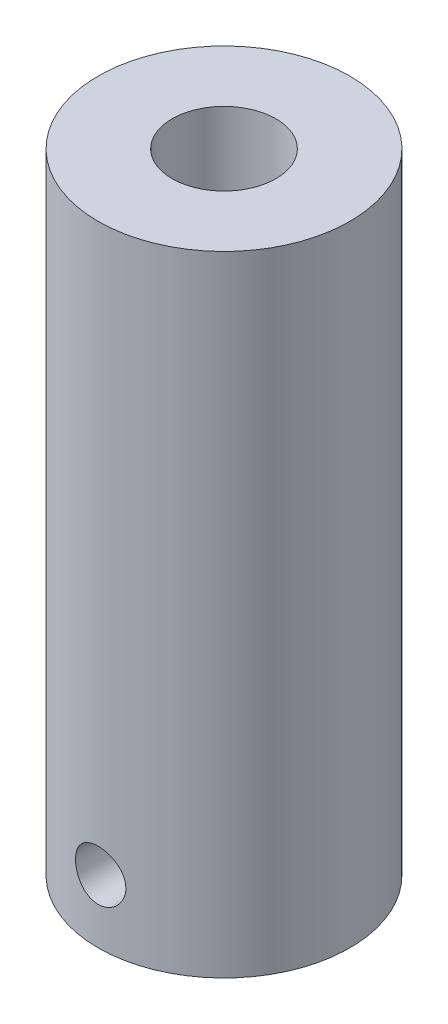
ISO-10303-21;
HEADER;
FILE_DESCRIPTION(('STEP AP214'),'2;1');
FILE_NAME('part.step','',(''),(''),'','','');
FILE_SCHEMA(('AUTOMOTIVE_DESIGN { 1 0 10303 214 1 1 1 1 }'));
ENDSEC;
DATA;
#1=APPLICATION_CONTEXT('core data for automotive mechanical design processes');
#2=APPLICATION_PROTOCOL_DEFINITION('international standard','automotive_design',2000,#1);
#3=PRODUCT_CONTEXT('',#1,'mechanical');
#4=PRODUCT('Part','Part','',(#3));
#5=PRODUCT_RELATED_PRODUCT_CATEGORY('part','',(#4));
#6=PRODUCT_DEFINITION_FORMATION('','',#4);
#7=PRODUCT_DEFINITION_CONTEXT('part definition',#1,'design');
#8=PRODUCT_DEFINITION('design','',#6,#7);
#9=PRODUCT_DEFINITION_SHAPE('','',#8);
#10=(LENGTH_UNIT() NAMED_UNIT(*) SI_UNIT(.MILLI.,.METRE.));
#11=(NAMED_UNIT(*) PLANE_ANGLE_UNIT() SI_UNIT($,.RADIAN.));
#12=(NAMED_UNIT(*) SI_UNIT($,.STERADIAN.) SOLID_ANGLE_UNIT());
#13=UNCERTAINTY_MEASURE_WITH_UNIT(LENGTH_MEASURE(1.E-05),#10,'distance_accuracy_value','');
#14=(GEOMETRIC_REPRESENTATION_CONTEXT(3) GLOBAL_UNCERTAINTY_ASSIGNED_CONTEXT((#13)) GLOBAL_UNIT_ASSIGNED_CONTEXT((#10,
#11,#12)) REPRESENTATION_CONTEXT('',''));
#15=CARTESIAN_POINT('',(0.,0.,0.));
#16=DIRECTION('',(0.,0.,1.));
#17=DIRECTION('',(1.,0.,0.));
#18=AXIS2_PLACEMENT_3D('',#15,#16,#17);
#19=CARTESIAN_POINT('',(0.,25.4,0.));
#20=DIRECTION('',(0.,-1.,0.));
#21=DIRECTION('',(0.,0.,-1.));
#22=AXIS2_PLACEMENT_3D('',#19,#20,#21);
#23=CYLINDRICAL_SURFACE('',#22,4.);
#24=CARTESIAN_POINT('',(-0.8,5.,3.91918358845308));
#25=CARTESIAN_POINT('',(-0.799998356700836,4.95554849961442,3.91918447235146));
#26=CARTESIAN_POINT('',(-0.796282537378925,4.91107630135481,3.91994806677531));
#27=CARTESIAN_POINT('',(-0.781529826870668,4.82338999590527,3.9229154510821));
#28=CARTESIAN_POINT('',(-0.770487077656945,4.78017692429514,3.92512039333066));
#29=CARTESIAN_POINT('',(-0.74143662609419,4.69629015730966,3.93071098960285));
#30=CARTESIAN_POINT('',(-0.723435851321666,4.65561398277206,3.9340954689225));
#31=CARTESIAN_POINT('',(-0.680999286136834,4.57786012424431,3.94166239589137));
#32=CARTESIAN_POINT('',(-0.656563854881037,4.54078223957018,3.94584479900011));
#33=CARTESIAN_POINT('',(-0.601583260522632,4.4707511969164,3.95460239754144));
#34=CARTESIAN_POINT('',(-0.570964524730623,4.43785632969268,3.9591819026946));
#35=CARTESIAN_POINT('',(-0.50464543121708,4.37763397313695,3.96817977842416));
#36=CARTESIAN_POINT('',(-0.468944717582396,4.35030687406628,3.97259813768756));
#37=CARTESIAN_POINT('',(-0.393089084739396,4.3017695858972,3.98082237133958));
#38=CARTESIAN_POINT('',(-0.352898054137767,4.28061478894668,3.98462257153216));
#39=CARTESIAN_POINT('',(-0.26944332030982,4.2453800503615,3.9911338950693));
#40=CARTESIAN_POINT('',(-0.226179905136443,4.23129944647921,3.99384512035302));
#41=CARTESIAN_POINT('',(-0.138413418622795,4.2107942451043,3.99784256550728));
#42=CARTESIAN_POINT('',(-0.0939341913718513,4.20427121794319,3.999147090305));
#43=CARTESIAN_POINT('',(-0.00449485475002944,4.19875923852935,4.00024736946885));
#44=CARTESIAN_POINT('',(0.0404652078654742,4.19976956028334,4.00004326922208));
#45=CARTESIAN_POINT('',(0.128913600594871,4.20922094417244,3.99816347894812));
#46=CARTESIAN_POINT('',(0.172413771438776,4.21755598173428,3.99650878692671));
#47=CARTESIAN_POINT('',(0.257385301264241,4.24125202596711,3.99193741727527));
#48=CARTESIAN_POINT('',(0.298856578997703,4.2566133137535,3.98902068915231));
#49=CARTESIAN_POINT('',(0.37889557056071,4.29402403211782,3.98221836815967));
#50=CARTESIAN_POINT('',(0.41744333930712,4.31611500088391,3.97832678540179));
#51=CARTESIAN_POINT('',(0.490324036687805,4.36632726178928,3.97000375579028));
#52=CARTESIAN_POINT('',(0.524656479620001,4.39444924781641,3.96557224684178));
#53=CARTESIAN_POINT('',(0.588761144842766,4.45650689768678,3.95656771491568));
#54=CARTESIAN_POINT('',(0.618443453258905,4.49053534938367,3.95199357166013));
#55=CARTESIAN_POINT('',(0.671694794541446,4.5631331539606,3.94329257279008));
#56=CARTESIAN_POINT('',(0.695263711782201,4.60170259270656,3.93916572563639));
#57=CARTESIAN_POINT('',(0.735650251841505,4.68241666545744,3.93182437978339));
#58=CARTESIAN_POINT('',(0.752453318222168,4.72456877411173,3.92861185250839));
#59=CARTESIAN_POINT('',(0.778712273302066,4.81117705897919,3.92349181057018));
#60=CARTESIAN_POINT('',(0.788169119565314,4.85563293409527,3.92158412582742));
#61=CARTESIAN_POINT('',(0.799332804828841,4.94477188639924,3.91932383414262));
#62=CARTESIAN_POINT('',(0.801169487118329,4.98943805944827,3.91894517645723));
#63=CARTESIAN_POINT('',(0.797390102648591,5.07843857855975,3.91971588551083));
#64=CARTESIAN_POINT('',(0.791774458497954,5.12277294329509,3.9208651656031));
#65=CARTESIAN_POINT('',(0.773361766459325,5.20941491223379,3.92453785995932));
#66=CARTESIAN_POINT('',(0.760634096671438,5.25173787442861,3.92704799211597));
#67=CARTESIAN_POINT('',(0.728432828246814,5.33365062322299,3.93314791481332));
#68=CARTESIAN_POINT('',(0.708958673898542,5.37324018434858,3.93673779429016));
#69=CARTESIAN_POINT('',(0.663523313772479,5.44913048796013,3.94465124769632));
#70=CARTESIAN_POINT('',(0.637480862386203,5.48538163704066,3.94898377491923));
#71=CARTESIAN_POINT('',(0.57975645777017,5.55304664960073,3.95786979061309));
#72=CARTESIAN_POINT('',(0.54807392411563,5.5844600145994,3.96242330179054));
#73=CARTESIAN_POINT('',(0.479385818798313,5.64205004734846,3.97132276695372));
#74=CARTESIAN_POINT('',(0.442305999143704,5.66813892372,3.97566446166947));
#75=CARTESIAN_POINT('',(0.364214317307805,5.71371670519967,3.98357702102896));
#76=CARTESIAN_POINT('',(0.323202620346806,5.73320588747583,3.98714791804169));
#77=CARTESIAN_POINT('',(0.23864214465921,5.76490309739731,3.99309835248853));
#78=CARTESIAN_POINT('',(0.195109338782462,5.777152414581,3.99548463314083));
#79=CARTESIAN_POINT('',(0.10655156374393,5.79415299813108,3.99882588750128));
#80=CARTESIAN_POINT('',(0.0615267749689716,5.79890516758055,3.99978103359875));
#81=CARTESIAN_POINT('',(-0.0278983151228984,5.80074158477031,4.00014832363297));
#82=CARTESIAN_POINT('',(-0.0722958497132015,5.79795782436497,3.99958702839481));
#83=CARTESIAN_POINT('',(-0.159976825052513,5.78509283956175,3.99704034848254));
#84=CARTESIAN_POINT('',(-0.203260279802953,5.77501170692154,3.99505498171481));
#85=CARTESIAN_POINT('',(-0.287402199796077,5.74789680632668,3.98988398692));
#86=CARTESIAN_POINT('',(-0.328265954592225,5.73087889749505,3.9867010979833));
#87=CARTESIAN_POINT('',(-0.406576976148762,5.69039020693528,3.97947777698706));
#88=CARTESIAN_POINT('',(-0.444023972613929,5.66691891527703,3.97543727716702));
#89=CARTESIAN_POINT('',(-0.515091112085086,5.61374449035034,3.96686079326295));
#90=CARTESIAN_POINT('',(-0.548639772893203,5.58394693089059,3.96231786737714));
#91=CARTESIAN_POINT('',(-0.610306094205477,5.51915980792338,3.95328978322898));
#92=CARTESIAN_POINT('',(-0.638422466562169,5.48416901642501,3.948804638903));
#93=CARTESIAN_POINT('',(-0.68871377556416,5.40953654663986,3.94034674199971));
#94=CARTESIAN_POINT('',(-0.710821451711813,5.36984883107171,3.93638002905062));
#95=CARTESIAN_POINT('',(-0.748019239430247,5.28725378136025,3.92948189747556));
#96=CARTESIAN_POINT('',(-0.763115716783432,5.24434940904167,3.92654954029565));
#97=CARTESIAN_POINT('',(-0.782935311883418,5.16779003565075,3.92263744903138));
#98=CARTESIAN_POINT('',(-0.789323118818388,5.13457166439084,3.92135027932529));
#99=CARTESIAN_POINT('',(-0.797856014368328,5.06757283635709,3.91962302766424));
#100=CARTESIAN_POINT('',(-0.800001249249644,5.03379239900146,3.91918291650621));
#101=CARTESIAN_POINT('',(-0.8,5.,3.91918358845308));
#102=B_SPLINE_CURVE_WITH_KNOTS('',3,(#24,#25,#26,#27,#28,#29,#30,#31,#32,#33,#34,#35,#36,#37,
#38,#39,#40,#41,#42,#43,#44,#45,#46,#47,#48,#49,#50,#51,#52,#53,#54,#55,#56,#57,#58,#59,#60,#61,
#62,#63,#64,#65,#66,#67,#68,#69,#70,#71,#72,#73,#74,#75,#76,#77,#78,#79,#80,#81,#82,#83,#84,#85,
#86,#87,#88,#89,#90,#91,#92,#93,#94,#95,#96,#97,#98,#99,#100,#101),.UNSPECIFIED.,.T.,.F.,(4,2,2,
2,2,2,2,2,2,2,2,2,2,2,2,2,2,2,2,2,2,2,2,2,2,2,2,2,2,2,2,2,2,2,2,2,2,2,4),(0.,0.13323077108522,
0.266568191407411,0.399773198332443,0.532970771867865,0.667858020367467,0.802754720263349,
0.938827203479576,1.07488694595245,1.20915399104462,1.34340809690996,1.47575031704827,
1.60809783256998,1.7412793937584,1.8744762861405,2.00999477407984,2.14551582496174,
2.28132690536219,2.41712028010817,2.55059006241672,2.68405227620735,2.81623473424653,
2.94842808281516,3.08234447817614,3.21627466294164,3.35226081384758,3.48824125302081,
3.62343850860918,3.758619477513,3.89144813929746,4.02427513091403,4.15680013658359,
4.28933561705745,4.42400921618475,4.55871471109822,4.6948711886123,4.83090380069144,
4.93219042907514,5.03347356545369),.UNSPECIFIED.);
#103=CARTESIAN_POINT('',(-0.8,5.,3.91918358845308));
#104=VERTEX_POINT('',#103);
#105=EDGE_CURVE('E59',#104,#104,#102,.T.);
#106=ORIENTED_EDGE('',*,*,#105,.F.);
#107=EDGE_LOOP('',(#106));
#108=FACE_BOUND('',#107,.T.);
#109=CARTESIAN_POINT('',(0.,3.,0.));
#110=DIRECTION('',(0.,1.,0.));
#111=DIRECTION('',(0.,0.,1.));
#112=AXIS2_PLACEMENT_3D('',#109,#110,#111);
#113=CIRCLE('',#112,4.);
#114=CARTESIAN_POINT('',(0.,3.,4.));
#115=VERTEX_POINT('',#114);
#116=EDGE_CURVE('E10',#115,#115,#113,.T.);
#117=ORIENTED_EDGE('',*,*,#116,.T.);
#118=EDGE_LOOP('',(#117));
#119=FACE_BOUND('',#118,.T.);
#120=CARTESIAN_POINT('',(0.,23.,0.));
#121=DIRECTION('',(0.,1.,0.));
#122=DIRECTION('',(0.,0.,1.));
#123=AXIS2_PLACEMENT_3D('',#120,#121,#122);
#124=CIRCLE('',#123,4.);
#125=CARTESIAN_POINT('',(0.,23.,4.));
#126=VERTEX_POINT('',#125);
#127=EDGE_CURVE('E39',#126,#126,#124,.T.);
#128=ORIENTED_EDGE('',*,*,#127,.F.);
#129=EDGE_LOOP('',(#128));
#130=FACE_BOUND('',#129,.T.);
#131=ADVANCED_FACE('F35',(#108,#119,#130),#23,.T.);
#132=CARTESIAN_POINT('',(0.,7.4,0.));
#133=DIRECTION('',(0.,-1.,0.));
#134=DIRECTION('',(0.,0.,-1.));
#135=AXIS2_PLACEMENT_3D('',#132,#133,#134);
#136=CYLINDRICAL_SURFACE('',#135,2.);
#137=CARTESIAN_POINT('',(0.,7.4,0.));
#138=DIRECTION('',(0.,1.,0.));
#139=DIRECTION('',(0.,0.,1.));
#140=AXIS2_PLACEMENT_3D('',#137,#138,#139);
#141=CIRCLE('',#140,2.);
#142=CARTESIAN_POINT('',(0.,7.4,2.));
#143=VERTEX_POINT('',#142);
#144=EDGE_CURVE('E48',#143,#143,#141,.T.);
#145=ORIENTED_EDGE('',*,*,#144,.T.);
#146=EDGE_LOOP('',(#145));
#147=FACE_BOUND('',#146,.T.);
#148=CARTESIAN_POINT('',(0.,3.,0.));
#149=DIRECTION('',(0.,-1.,0.));
#150=DIRECTION('',(0.,0.,-1.));
#151=AXIS2_PLACEMENT_3D('',#148,#149,#150);
#152=CIRCLE('',#151,2.);
#153=CARTESIAN_POINT('',(0.,3.,-2.));
#154=VERTEX_POINT('',#153);
#155=EDGE_CURVE('E43',#154,#154,#152,.F.);
#156=ORIENTED_EDGE('',*,*,#155,.F.);
#157=EDGE_LOOP('',(#156));
#158=FACE_BOUND('',#157,.T.);
#159=CARTESIAN_POINT('',(-0.8,5.,1.83303027798234));
#160=CARTESIAN_POINT('',(-0.799995301681515,4.95714420076004,1.83303460662569));
#161=CARTESIAN_POINT('',(-0.796535927437741,4.91422778611812,1.83455440993706));
#162=CARTESIAN_POINT('',(-0.782827612237092,4.82962606684917,1.84044365675138));
#163=CARTESIAN_POINT('',(-0.772561321776852,4.7879441931678,1.84482038154741));
#164=CARTESIAN_POINT('',(-0.745694013027482,4.70717882321198,1.85584182316519));
#165=CARTESIAN_POINT('',(-0.72911686101017,4.6680861810559,1.86247798542846));
#166=CARTESIAN_POINT('',(-0.690168107748645,4.59324597965615,1.87725866038112));
#167=CARTESIAN_POINT('',(-0.667797771707,4.55749769233966,1.88540284361569));
#168=CARTESIAN_POINT('',(-0.616528789834968,4.48829583910342,1.90280346020413));
#169=CARTESIAN_POINT('',(-0.587351743090931,4.45505743082821,1.91209567183498));
#170=CARTESIAN_POINT('',(-0.523883642309618,4.39378840107385,1.93044982791524));
#171=CARTESIAN_POINT('',(-0.489590808670272,4.36575959948406,1.93951169094549));
#172=CARTESIAN_POINT('',(-0.415202524142551,4.31463744120692,1.95681363162742));
#173=CARTESIAN_POINT('',(-0.374931586244912,4.29178227941174,1.96500721473427));
#174=CARTESIAN_POINT('',(-0.290730129150048,4.25326257264408,1.97921571052619));
#175=CARTESIAN_POINT('',(-0.246801107715185,4.23759510168722,1.98523150953869));
#176=CARTESIAN_POINT('',(-0.158786570735557,4.21466340542504,1.99415330003314));
#177=CARTESIAN_POINT('',(-0.114811593921842,4.20702907436439,1.99719574710143));
#178=CARTESIAN_POINT('',(-0.0261065314550606,4.19918860573492,2.00032124273081));
#179=CARTESIAN_POINT('',(0.0186232663301611,4.19897969762606,2.00040539507725));
#180=CARTESIAN_POINT('',(0.104892997886125,4.20579310790999,1.99768785128714));
#181=CARTESIAN_POINT('',(0.146470981149614,4.21240990909877,1.99504798708734));
#182=CARTESIAN_POINT('',(0.227869243687335,4.2319971505243,1.98739716587516));
#183=CARTESIAN_POINT('',(0.267689393756063,4.24496805696016,1.98238603488445));
#184=CARTESIAN_POINT('',(0.345159175404662,4.27705459315052,1.9703872978308));
#185=CARTESIAN_POINT('',(0.382767049351853,4.29625988592621,1.9633710418672));
#186=CARTESIAN_POINT('',(0.45432326029623,4.3401860027676,1.94805834071879));
#187=CARTESIAN_POINT('',(0.488270337086443,4.36490871723905,1.9397614570603));
#188=CARTESIAN_POINT('',(0.55390753119686,4.42105965437864,1.92208654871334));
#189=CARTESIAN_POINT('',(0.585303138109457,4.45282155703353,1.91267330608096));
#190=CARTESIAN_POINT('',(0.64244296615413,4.52119622872839,1.89424664385911));
#191=CARTESIAN_POINT('',(0.668185337503863,4.55781057926167,1.88523335590539));
#192=CARTESIAN_POINT('',(0.713961675497173,4.63616760896358,1.86838758976725));
#193=CARTESIAN_POINT('',(0.733813860693962,4.67802593219353,1.86059565672552));
#194=CARTESIAN_POINT('',(0.766070503986507,4.76488619618481,1.8475503618693));
#195=CARTESIAN_POINT('',(0.77847979936176,4.80988607390834,1.84229535169336));
#196=CARTESIAN_POINT('',(0.794781979532783,4.89881431097442,1.83531903869026));
#197=CARTESIAN_POINT('',(0.799148838723364,4.94264017884807,1.8334014657923));
#198=CARTESIAN_POINT('',(0.800624530579607,5.03043088310718,1.83275799150839));
#199=CARTESIAN_POINT('',(0.797735564237153,5.07439567331114,1.83403112224985));
#200=CARTESIAN_POINT('',(0.78521315791541,5.15858357398195,1.83942417742853));
#201=CARTESIAN_POINT('',(0.775973224809383,5.1988771749598,1.84337783119108));
#202=CARTESIAN_POINT('',(0.751521674764511,5.2773153619144,1.85348020411149));
#203=CARTESIAN_POINT('',(0.736308733720957,5.31545946924293,1.85962940995497));
#204=CARTESIAN_POINT('',(0.699654255792581,5.3902409431182,1.8737351274398));
#205=CARTESIAN_POINT('',(0.677985147305838,5.42675447547778,1.88175481855654));
#206=CARTESIAN_POINT('',(0.62926608977675,5.49579319497667,1.89860154063135));
#207=CARTESIAN_POINT('',(0.602213949392793,5.52831674911824,1.90742889958425));
#208=CARTESIAN_POINT('',(0.541137684672193,5.59094936343968,1.92568366388559));
#209=CARTESIAN_POINT('',(0.50674617177804,5.62070262611641,1.93510722914081));
#210=CARTESIAN_POINT('',(0.433233453347538,5.67407083064414,1.95287917827025));
#211=CARTESIAN_POINT('',(0.394112055387146,5.69768552263889,1.96122751837296));
#212=CARTESIAN_POINT('',(0.312111973600704,5.73801905058449,1.97593486360114));
#213=CARTESIAN_POINT('',(0.269234192397627,5.75473953766631,1.98229434496109));
#214=CARTESIAN_POINT('',(0.18095743636769,5.78061954096305,1.99229085387716));
#215=CARTESIAN_POINT('',(0.135559844117708,5.78978316057603,1.99592935883017));
#216=CARTESIAN_POINT('',(0.0467266041385213,5.79980188065016,1.99991603284205));
#217=CARTESIAN_POINT('',(0.00335619703722224,5.80116005138506,2.00046338697949));
#218=CARTESIAN_POINT('',(-0.0829735342932972,5.79685780828636,1.99874416951437));
#219=CARTESIAN_POINT('',(-0.125932919757849,5.79119845688575,1.99647802386765));
#220=CARTESIAN_POINT('',(-0.208868360778565,5.77338128465661,1.98948605345702));
#221=CARTESIAN_POINT('',(-0.248895521859355,5.76142842156978,1.98483792253732));
#222=CARTESIAN_POINT('',(-0.326368941903577,5.73157887817527,1.97357979132815));
#223=CARTESIAN_POINT('',(-0.363814723306911,5.71368110159186,1.96696942921605));
#224=CARTESIAN_POINT('',(-0.436881216742446,5.67155872060426,1.95207237744023));
#225=CARTESIAN_POINT('',(-0.472348154722571,5.64708948204597,1.94372451891292));
#226=CARTESIAN_POINT('',(-0.538821611409629,5.59288459232843,1.92635761274579));
#227=CARTESIAN_POINT('',(-0.569826274298302,5.56314676141595,1.917338288202));
#228=CARTESIAN_POINT('',(-0.628480506034396,5.49707391018998,1.89895105423769));
#229=CARTESIAN_POINT('',(-0.655803554879611,5.46044445063956,1.88959613042153));
#230=CARTESIAN_POINT('',(-0.703938980175759,5.38282314502849,1.87219868590072));
#231=CARTESIAN_POINT('',(-0.724750591159995,5.34183078683606,1.86415631954982));
#232=CARTESIAN_POINT('',(-0.757596435069324,5.26038511926077,1.85103545783163));
#233=CARTESIAN_POINT('',(-0.770251005665683,5.22021390609953,1.84575567444659));
#234=CARTESIAN_POINT('',(-0.789087103127354,5.13820583214786,1.83778401441586));
#235=CARTESIAN_POINT('',(-0.795286667155206,5.09637395361322,1.8350849282887));
#236=CARTESIAN_POINT('',(-0.799385703324069,5.03624897506483,1.83329783503054));
#237=CARTESIAN_POINT('',(-0.800001987597952,5.01812991160096,1.83302844677343));
#238=CARTESIAN_POINT('',(-0.8,5.,1.83303027798234));
#239=B_SPLINE_CURVE_WITH_KNOTS('',3,(#159,#160,#161,#162,#163,#164,#165,#166,#167,#168,#169,
#170,#171,#172,#173,#174,#175,#176,#177,#178,#179,#180,#181,#182,#183,#184,#185,#186,#187,#188,
#189,#190,#191,#192,#193,#194,#195,#196,#197,#198,#199,#200,#201,#202,#203,#204,#205,#206,#207,
#208,#209,#210,#211,#212,#213,#214,#215,#216,#217,#218,#219,#220,#221,#222,#223,#224,#225,#226,
#227,#228,#229,#230,#231,#232,#233,#234,#235,#236,#237,#238),.UNSPECIFIED.,.T.,.F.,(4,2,2,2,2,2,
2,2,2,2,2,2,2,2,2,2,2,2,2,2,2,2,2,2,2,2,2,2,2,2,2,2,2,2,2,2,2,2,2,4),(0.,0.128511059507061,
0.257350934328898,0.385708329317356,0.514037715295446,0.6490224731377,0.78405429739337,
0.924410676365714,1.06470986787792,1.19821673154873,1.33167378122269,1.45763457932121,
1.58360462051624,1.71147320093959,1.83938565976013,1.97569617632542,2.11205122850851,
2.25225783485831,2.39237321917645,2.52392859007372,2.6554440596078,2.77946899231662,
2.90352143458259,3.03260461858685,3.16174045807944,3.30041493696396,3.43909505938703,
3.57774194922729,3.71631350379259,3.84584415899985,3.97535520602645,4.10088797774945,
4.22644391129038,4.35754820453574,4.48870686623286,4.62798501311849,4.76727952701279,
4.89406664325235,5.02049852085302,5.07486442208293),.UNSPECIFIED.);
#240=CARTESIAN_POINT('',(-0.8,5.,1.83303027798234));
#241=VERTEX_POINT('',#240);
#242=EDGE_CURVE('E52',#241,#241,#239,.T.);
#243=ORIENTED_EDGE('',*,*,#242,.T.);
#244=EDGE_LOOP('',(#243));
#245=FACE_BOUND('',#244,.T.);
#246=ADVANCED_FACE('F60',(#147,#158,#245),#136,.F.);
#247=CARTESIAN_POINT('',(0.,3.,0.));
#248=DIRECTION('',(0.,-1.,0.));
#249=DIRECTION('',(0.,0.,-1.));
#250=AXIS2_PLACEMENT_3D('',#247,#248,#249);
#251=PLANE('',#250);
#252=ORIENTED_EDGE('',*,*,#155,.T.);
#253=EDGE_LOOP('',(#252));
#254=FACE_BOUND('',#253,.T.);
#255=ORIENTED_EDGE('',*,*,#116,.F.);
#256=EDGE_LOOP('',(#255));
#257=FACE_BOUND('',#256,.T.);
#258=ADVANCED_FACE('F93',(#254,#257),#251,.T.);
#259=CARTESIAN_POINT('',(0.,7.4,0.));
#260=DIRECTION('',(0.,1.,0.));
#261=DIRECTION('',(0.,0.,1.));
#262=AXIS2_PLACEMENT_3D('',#259,#260,#261);
#263=PLANE('',#262);
#264=ORIENTED_EDGE('',*,*,#144,.F.);
#265=EDGE_LOOP('',(#264));
#266=FACE_BOUND('',#265,.T.);
#267=ADVANCED_FACE('F68',(#266),#263,.F.);
#268=CARTESIAN_POINT('',(0.,5.,10.));
#269=DIRECTION('',(0.,0.,-1.));
#270=DIRECTION('',(-1.,0.,0.));
#271=AXIS2_PLACEMENT_3D('',#268,#269,#270);
#272=CYLINDRICAL_SURFACE('',#271,0.8);
#273=ORIENTED_EDGE('',*,*,#242,.F.);
#274=EDGE_LOOP('',(#273));
#275=FACE_BOUND('',#274,.T.);
#276=ORIENTED_EDGE('',*,*,#105,.T.);
#277=EDGE_LOOP('',(#276));
#278=FACE_BOUND('',#277,.T.);
#279=ADVANCED_FACE('F63',(#275,#278),#272,.F.);
#280=CARTESIAN_POINT('',(0.,23.,0.));
#281=DIRECTION('',(0.,1.,0.));
#282=DIRECTION('',(0.,0.,1.));
#283=AXIS2_PLACEMENT_3D('',#280,#281,#282);
#284=PLANE('',#283);
#285=CARTESIAN_POINT('',(0.,23.,0.));
#286=DIRECTION('',(0.,1.,0.));
#287=DIRECTION('',(0.,0.,1.));
#288=AXIS2_PLACEMENT_3D('',#285,#286,#287);
#289=CIRCLE('',#288,1.65);
#290=CARTESIAN_POINT('',(0.,23.,1.65));
#291=VERTEX_POINT('',#290);
#292=EDGE_CURVE('E77',#291,#291,#289,.T.);
#293=ORIENTED_EDGE('',*,*,#292,.F.);
#294=EDGE_LOOP('',(#293));
#295=FACE_BOUND('',#294,.T.);
#296=ORIENTED_EDGE('',*,*,#127,.T.);
#297=EDGE_LOOP('',(#296));
#298=FACE_BOUND('',#297,.T.);
#299=ADVANCED_FACE('F67',(#295,#298),#284,.T.);
#300=CARTESIAN_POINT('',(0.,13.,0.));
#301=DIRECTION('',(0.,1.,0.));
#302=DIRECTION('',(0.,0.,1.));
#303=AXIS2_PLACEMENT_3D('',#300,#301,#302);
#304=CYLINDRICAL_SURFACE('',#303,1.65);
#305=CARTESIAN_POINT('',(0.,13.,0.));
#306=DIRECTION('',(0.,1.,0.));
#307=DIRECTION('',(0.,0.,1.));
#308=AXIS2_PLACEMENT_3D('',#305,#306,#307);
#309=CIRCLE('',#308,1.65);
#310=CARTESIAN_POINT('',(0.,13.,1.65));
#311=VERTEX_POINT('',#310);
#312=EDGE_CURVE('E80',#311,#311,#309,.T.);
#313=ORIENTED_EDGE('',*,*,#312,.F.);
#314=EDGE_LOOP('',(#313));
#315=FACE_BOUND('',#314,.T.);
#316=ORIENTED_EDGE('',*,*,#292,.T.);
#317=EDGE_LOOP('',(#316));
#318=FACE_BOUND('',#317,.T.);
#319=ADVANCED_FACE('F124',(#315,#318),#304,.F.);
#320=CARTESIAN_POINT('',(0.,13.,0.));
#321=DIRECTION('',(0.,1.,0.));
#322=DIRECTION('',(0.,0.,1.));
#323=AXIS2_PLACEMENT_3D('',#320,#321,#322);
#324=PLANE('',#323);
#325=ORIENTED_EDGE('',*,*,#312,.T.);
#326=EDGE_LOOP('',(#325));
#327=FACE_BOUND('',#326,.T.);
#328=ADVANCED_FACE('F131',(#327),#324,.T.);
#329=CLOSED_SHELL('',(#131,#246,#258,#267,#279,#299,#319,#328));
#330=MANIFOLD_SOLID_BREP('B2',#329);
#331=ADVANCED_BREP_SHAPE_REPRESENTATION('',(#18,#330),#14);
#332=SHAPE_DEFINITION_REPRESENTATION(#9,#331);
ENDSEC;
END-ISO-10303-21;
